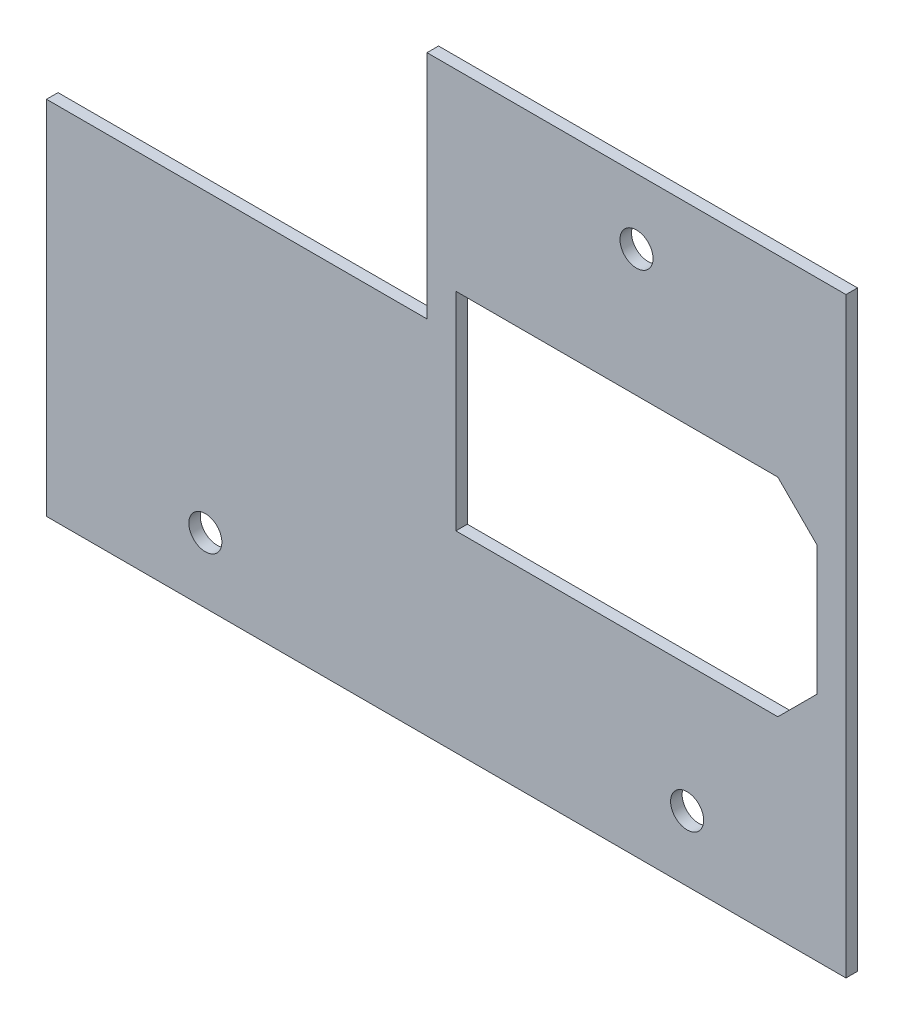
ISO-10303-21;
HEADER;
FILE_DESCRIPTION(('STEP AP214'),'2;1');
FILE_NAME('part.step','',(''),(''),'','','');
FILE_SCHEMA(('AUTOMOTIVE_DESIGN { 1 0 10303 214 1 1 1 1 }'));
ENDSEC;
DATA;
#1=APPLICATION_CONTEXT('core data for automotive mechanical design processes');
#2=APPLICATION_PROTOCOL_DEFINITION('international standard','automotive_design',2000,#1);
#3=PRODUCT_CONTEXT('',#1,'mechanical');
#4=PRODUCT('Part','Part','',(#3));
#5=PRODUCT_RELATED_PRODUCT_CATEGORY('part','',(#4));
#6=PRODUCT_DEFINITION_FORMATION('','',#4);
#7=PRODUCT_DEFINITION_CONTEXT('part definition',#1,'design');
#8=PRODUCT_DEFINITION('design','',#6,#7);
#9=PRODUCT_DEFINITION_SHAPE('','',#8);
#10=(LENGTH_UNIT() NAMED_UNIT(*) SI_UNIT(.MILLI.,.METRE.));
#11=(NAMED_UNIT(*) PLANE_ANGLE_UNIT() SI_UNIT($,.RADIAN.));
#12=(NAMED_UNIT(*) SI_UNIT($,.STERADIAN.) SOLID_ANGLE_UNIT());
#13=UNCERTAINTY_MEASURE_WITH_UNIT(LENGTH_MEASURE(1.E-05),#10,'distance_accuracy_value','');
#14=(GEOMETRIC_REPRESENTATION_CONTEXT(3) GLOBAL_UNCERTAINTY_ASSIGNED_CONTEXT((#13)) GLOBAL_UNIT_ASSIGNED_CONTEXT((#10,
#11,#12)) REPRESENTATION_CONTEXT('',''));
#15=CARTESIAN_POINT('',(0.,0.,0.));
#16=DIRECTION('',(0.,0.,1.));
#17=DIRECTION('',(1.,0.,0.));
#18=AXIS2_PLACEMENT_3D('',#15,#16,#17);
#19=CARTESIAN_POINT('',(93.499999998425,65.5289402294532,-21.5));
#20=DIRECTION('',(0.,1.,0.));
#21=DIRECTION('',(-1.,0.,0.));
#22=AXIS2_PLACEMENT_3D('',#19,#20,#21);
#23=PLANE('',#22);
#24=DIRECTION('',(-1.,0.,0.));
#25=VECTOR('',#24,1.);
#26=CARTESIAN_POINT('',(93.499999998425,65.5289402294532,-20.));
#27=LINE('',#26,#25);
#28=CARTESIAN_POINT('',(148.003126518284,65.5289402294535,-20.));
#29=VERTEX_POINT('',#28);
#30=CARTESIAN_POINT('',(93.499999998425,65.5289402294532,-20.));
#31=VERTEX_POINT('',#30);
#32=EDGE_CURVE('E243',#29,#31,#27,.T.);
#33=ORIENTED_EDGE('',*,*,#32,.F.);
#34=DIRECTION('',(0.,0.,1.));
#35=VECTOR('',#34,1.);
#36=CARTESIAN_POINT('',(148.003126518284,65.5289402294535,-21.5));
#37=LINE('',#36,#35);
#38=CARTESIAN_POINT('',(148.003126518284,65.5289402294535,-21.5));
#39=VERTEX_POINT('',#38);
#40=EDGE_CURVE('E11',#39,#29,#37,.T.);
#41=ORIENTED_EDGE('',*,*,#40,.F.);
#42=DIRECTION('',(-1.,0.,0.));
#43=VECTOR('',#42,1.);
#44=CARTESIAN_POINT('',(93.499999998425,65.5289402294532,-21.5));
#45=LINE('',#44,#43);
#46=CARTESIAN_POINT('',(93.499999998425,65.5289402294532,-21.5));
#47=VERTEX_POINT('',#46);
#48=EDGE_CURVE('E244',#39,#47,#45,.T.);
#49=ORIENTED_EDGE('',*,*,#48,.T.);
#50=DIRECTION('',(0.,0.,1.));
#51=VECTOR('',#50,1.);
#52=CARTESIAN_POINT('',(93.499999998425,65.5289402294532,-21.5));
#53=LINE('',#52,#51);
#54=EDGE_CURVE('E44',#47,#31,#53,.T.);
#55=ORIENTED_EDGE('',*,*,#54,.T.);
#56=EDGE_LOOP('',(#33,#41,#49,#55));
#57=FACE_BOUND('',#56,.T.);
#58=ADVANCED_FACE('F41',(#57),#23,.T.);
#59=CARTESIAN_POINT('',(148.003126518284,65.5289402294535,-21.5));
#60=DIRECTION('',(1.,0.,0.));
#61=DIRECTION('',(0.,1.,0.));
#62=AXIS2_PLACEMENT_3D('',#59,#60,#61);
#63=PLANE('',#62);
#64=DIRECTION('',(0.,1.,0.));
#65=VECTOR('',#64,1.);
#66=CARTESIAN_POINT('',(148.003126518284,65.5289402294535,-20.));
#67=LINE('',#66,#65);
#68=CARTESIAN_POINT('',(148.003126518284,-11.4710597708542,-20.));
#69=VERTEX_POINT('',#68);
#70=EDGE_CURVE('E249',#69,#29,#67,.T.);
#71=ORIENTED_EDGE('',*,*,#70,.F.);
#72=DIRECTION('',(0.,0.,1.));
#73=VECTOR('',#72,1.);
#74=CARTESIAN_POINT('',(148.003126518284,-11.4710597708542,-21.5));
#75=LINE('',#74,#73);
#76=CARTESIAN_POINT('',(148.003126518284,-11.4710597708542,-21.5));
#77=VERTEX_POINT('',#76);
#78=EDGE_CURVE('E50',#77,#69,#75,.T.);
#79=ORIENTED_EDGE('',*,*,#78,.F.);
#80=DIRECTION('',(0.,1.,0.));
#81=VECTOR('',#80,1.);
#82=CARTESIAN_POINT('',(148.003126518284,65.5289402294535,-21.5));
#83=LINE('',#82,#81);
#84=EDGE_CURVE('E265',#77,#39,#83,.T.);
#85=ORIENTED_EDGE('',*,*,#84,.T.);
#86=ORIENTED_EDGE('',*,*,#40,.T.);
#87=EDGE_LOOP('',(#71,#79,#85,#86));
#88=FACE_BOUND('',#87,.T.);
#89=ADVANCED_FACE('F311',(#88),#63,.T.);
#90=CARTESIAN_POINT('',(43.9999999999999,-11.4710597708542,-21.5));
#91=DIRECTION('',(0.,-1.,0.));
#92=DIRECTION('',(1.,0.,0.));
#93=AXIS2_PLACEMENT_3D('',#90,#91,#92);
#94=PLANE('',#93);
#95=DIRECTION('',(1.,0.,0.));
#96=VECTOR('',#95,1.);
#97=CARTESIAN_POINT('',(43.9999999999999,-11.4710597708542,-20.));
#98=LINE('',#97,#96);
#99=CARTESIAN_POINT('',(43.9999999999999,-11.4710597708542,-20.));
#100=VERTEX_POINT('',#99);
#101=EDGE_CURVE('E284',#100,#69,#98,.T.);
#102=ORIENTED_EDGE('',*,*,#101,.F.);
#103=DIRECTION('',(0.,0.,1.));
#104=VECTOR('',#103,1.);
#105=CARTESIAN_POINT('',(43.9999999999999,-11.4710597708542,-21.5));
#106=LINE('',#105,#104);
#107=CARTESIAN_POINT('',(43.9999999999999,-11.4710597708542,-21.5));
#108=VERTEX_POINT('',#107);
#109=EDGE_CURVE('E292',#108,#100,#106,.T.);
#110=ORIENTED_EDGE('',*,*,#109,.F.);
#111=DIRECTION('',(1.,0.,0.));
#112=VECTOR('',#111,1.);
#113=CARTESIAN_POINT('',(43.9999999999999,-11.4710597708542,-21.5));
#114=LINE('',#113,#112);
#115=EDGE_CURVE('E261',#108,#77,#114,.T.);
#116=ORIENTED_EDGE('',*,*,#115,.T.);
#117=ORIENTED_EDGE('',*,*,#78,.T.);
#118=EDGE_LOOP('',(#102,#110,#116,#117));
#119=FACE_BOUND('',#118,.T.);
#120=ADVANCED_FACE('F324',(#119),#94,.T.);
#121=CARTESIAN_POINT('',(43.9999999999999,35.5289402294536,-21.5));
#122=DIRECTION('',(-1.,0.,0.));
#123=DIRECTION('',(0.,-1.,0.));
#124=AXIS2_PLACEMENT_3D('',#121,#122,#123);
#125=PLANE('',#124);
#126=DIRECTION('',(0.,-1.,0.));
#127=VECTOR('',#126,1.);
#128=CARTESIAN_POINT('',(43.9999999999999,35.5289402294536,-20.));
#129=LINE('',#128,#127);
#130=CARTESIAN_POINT('',(43.9999999999999,35.5289402294536,-20.));
#131=VERTEX_POINT('',#130);
#132=EDGE_CURVE('E280',#131,#100,#129,.T.);
#133=ORIENTED_EDGE('',*,*,#132,.F.);
#134=DIRECTION('',(0.,0.,1.));
#135=VECTOR('',#134,1.);
#136=CARTESIAN_POINT('',(43.9999999999999,35.5289402294536,-21.5));
#137=LINE('',#136,#135);
#138=CARTESIAN_POINT('',(43.9999999999999,35.5289402294536,-21.5));
#139=VERTEX_POINT('',#138);
#140=EDGE_CURVE('E294',#139,#131,#137,.T.);
#141=ORIENTED_EDGE('',*,*,#140,.F.);
#142=DIRECTION('',(0.,-1.,0.));
#143=VECTOR('',#142,1.);
#144=CARTESIAN_POINT('',(43.9999999999999,35.5289402294536,-21.5));
#145=LINE('',#144,#143);
#146=EDGE_CURVE('E257',#139,#108,#145,.T.);
#147=ORIENTED_EDGE('',*,*,#146,.T.);
#148=ORIENTED_EDGE('',*,*,#109,.T.);
#149=EDGE_LOOP('',(#133,#141,#147,#148));
#150=FACE_BOUND('',#149,.T.);
#151=ADVANCED_FACE('F322',(#150),#125,.T.);
#152=CARTESIAN_POINT('',(93.4999999984248,35.5289402294536,-21.5));
#153=DIRECTION('',(0.,1.,0.));
#154=DIRECTION('',(-1.,0.,0.));
#155=AXIS2_PLACEMENT_3D('',#152,#153,#154);
#156=PLANE('',#155);
#157=DIRECTION('',(-1.,0.,0.));
#158=VECTOR('',#157,1.);
#159=CARTESIAN_POINT('',(93.4999999984248,35.5289402294536,-20.));
#160=LINE('',#159,#158);
#161=CARTESIAN_POINT('',(93.4999999984248,35.5289402294536,-20.));
#162=VERTEX_POINT('',#161);
#163=EDGE_CURVE('E276',#162,#131,#160,.T.);
#164=ORIENTED_EDGE('',*,*,#163,.F.);
#165=DIRECTION('',(0.,0.,1.));
#166=VECTOR('',#165,1.);
#167=CARTESIAN_POINT('',(93.4999999984248,35.5289402294536,-21.5));
#168=LINE('',#167,#166);
#169=CARTESIAN_POINT('',(93.4999999984248,35.5289402294536,-21.5));
#170=VERTEX_POINT('',#169);
#171=EDGE_CURVE('E296',#170,#162,#168,.T.);
#172=ORIENTED_EDGE('',*,*,#171,.F.);
#173=DIRECTION('',(-1.,0.,0.));
#174=VECTOR('',#173,1.);
#175=CARTESIAN_POINT('',(93.4999999984248,35.5289402294536,-21.5));
#176=LINE('',#175,#174);
#177=EDGE_CURVE('E253',#170,#139,#176,.T.);
#178=ORIENTED_EDGE('',*,*,#177,.T.);
#179=ORIENTED_EDGE('',*,*,#140,.T.);
#180=EDGE_LOOP('',(#164,#172,#178,#179));
#181=FACE_BOUND('',#180,.T.);
#182=ADVANCED_FACE('F319',(#181),#156,.T.);
#183=CARTESIAN_POINT('',(93.499999998425,65.5289402294532,-21.5));
#184=DIRECTION('',(-1.,0.,0.));
#185=DIRECTION('',(0.,-1.,0.));
#186=AXIS2_PLACEMENT_3D('',#183,#184,#185);
#187=PLANE('',#186);
#188=DIRECTION('',(0.,-1.,0.));
#189=VECTOR('',#188,1.);
#190=CARTESIAN_POINT('',(93.499999998425,65.5289402294532,-20.));
#191=LINE('',#190,#189);
#192=EDGE_CURVE('E272',#31,#162,#191,.T.);
#193=ORIENTED_EDGE('',*,*,#192,.F.);
#194=ORIENTED_EDGE('',*,*,#54,.F.);
#195=DIRECTION('',(0.,-1.,0.));
#196=VECTOR('',#195,1.);
#197=CARTESIAN_POINT('',(93.499999998425,65.5289402294532,-21.5));
#198=LINE('',#197,#196);
#199=EDGE_CURVE('E248',#47,#170,#198,.T.);
#200=ORIENTED_EDGE('',*,*,#199,.T.);
#201=ORIENTED_EDGE('',*,*,#171,.T.);
#202=EDGE_LOOP('',(#193,#194,#200,#201));
#203=FACE_BOUND('',#202,.T.);
#204=ADVANCED_FACE('F306',(#203),#187,.T.);
#205=CARTESIAN_POINT('',(0.,0.,-21.5));
#206=DIRECTION('',(0.,0.,-1.));
#207=DIRECTION('',(-1.,0.,0.));
#208=AXIS2_PLACEMENT_3D('',#205,#206,#207);
#209=PLANE('',#208);
#210=DIRECTION('',(0.,1.,0.));
#211=VECTOR('',#210,1.);
#212=CARTESIAN_POINT('',(97.2515632583544,40.5289402292996,-21.5));
#213=LINE('',#212,#211);
#214=CARTESIAN_POINT('',(97.2515632583544,13.5289402292996,-21.5));
#215=VERTEX_POINT('',#214);
#216=CARTESIAN_POINT('',(97.2515632583544,40.5289402292996,-21.5));
#217=VERTEX_POINT('',#216);
#218=EDGE_CURVE('E61',#215,#217,#213,.T.);
#219=ORIENTED_EDGE('',*,*,#218,.F.);
#220=DIRECTION('',(-1.,0.,0.));
#221=VECTOR('',#220,1.);
#222=CARTESIAN_POINT('',(97.2515632583544,13.5289402292996,-21.5));
#223=LINE('',#222,#221);
#224=CARTESIAN_POINT('',(139.139101480728,13.5289402292996,-21.5));
#225=VERTEX_POINT('',#224);
#226=EDGE_CURVE('E173',#225,#215,#223,.T.);
#227=ORIENTED_EDGE('',*,*,#226,.F.);
#228=DIRECTION('',(-0.707106781186548,-0.707106781186547,0.));
#229=VECTOR('',#228,1.);
#230=CARTESIAN_POINT('',(139.139101480728,13.5289402292996,-21.5));
#231=LINE('',#230,#229);
#232=CARTESIAN_POINT('',(144.251563258354,18.6414020069259,-21.5));
#233=VERTEX_POINT('',#232);
#234=EDGE_CURVE('E177',#233,#225,#231,.T.);
#235=ORIENTED_EDGE('',*,*,#234,.F.);
#236=DIRECTION('',(0.,-1.,0.));
#237=VECTOR('',#236,1.);
#238=CARTESIAN_POINT('',(144.251563258354,35.4164784516734,-21.5));
#239=LINE('',#238,#237);
#240=CARTESIAN_POINT('',(144.251563258354,35.4164784516734,-21.5));
#241=VERTEX_POINT('',#240);
#242=EDGE_CURVE('E200',#241,#233,#239,.T.);
#243=ORIENTED_EDGE('',*,*,#242,.F.);
#244=DIRECTION('',(0.707106781186548,-0.707106781186547,0.));
#245=VECTOR('',#244,1.);
#246=CARTESIAN_POINT('',(139.139101480728,40.5289402292996,-21.5));
#247=LINE('',#246,#245);
#248=CARTESIAN_POINT('',(139.139101480728,40.5289402292996,-21.5));
#249=VERTEX_POINT('',#248);
#250=EDGE_CURVE('E196',#249,#241,#247,.T.);
#251=ORIENTED_EDGE('',*,*,#250,.F.);
#252=DIRECTION('',(1.,0.,0.));
#253=VECTOR('',#252,1.);
#254=CARTESIAN_POINT('',(97.2515632583544,40.5289402292996,-21.5));
#255=LINE('',#254,#253);
#256=EDGE_CURVE('E193',#217,#249,#255,.T.);
#257=ORIENTED_EDGE('',*,*,#256,.F.);
#258=EDGE_LOOP('',(#219,#227,#235,#243,#251,#257));
#259=FACE_BOUND('',#258,.T.);
#260=CARTESIAN_POINT('',(120.751563258354,57.0289402294535,-21.5));
#261=DIRECTION('',(0.,0.,-1.));
#262=DIRECTION('',(-1.,0.,0.));
#263=AXIS2_PLACEMENT_3D('',#260,#261,#262);
#264=CIRCLE('',#263,2.15);
#265=CARTESIAN_POINT('',(118.601563258354,57.0289402294535,-21.5));
#266=VERTEX_POINT('',#265);
#267=EDGE_CURVE('E210',#266,#266,#264,.T.);
#268=ORIENTED_EDGE('',*,*,#267,.F.);
#269=EDGE_LOOP('',(#268));
#270=FACE_BOUND('',#269,.T.);
#271=CARTESIAN_POINT('',(127.339384783388,-2.97105977085422,-21.5));
#272=DIRECTION('',(0.,0.,-1.));
#273=DIRECTION('',(-1.,0.,0.));
#274=AXIS2_PLACEMENT_3D('',#271,#272,#273);
#275=CIRCLE('',#274,2.14999999999999);
#276=CARTESIAN_POINT('',(125.189384783388,-2.97105977085422,-21.5));
#277=VERTEX_POINT('',#276);
#278=EDGE_CURVE('E229',#277,#277,#275,.T.);
#279=ORIENTED_EDGE('',*,*,#278,.F.);
#280=EDGE_LOOP('',(#279));
#281=FACE_BOUND('',#280,.T.);
#282=CARTESIAN_POINT('',(64.6637417348955,-2.97105977085421,-21.5));
#283=DIRECTION('',(0.,0.,-1.));
#284=DIRECTION('',(-1.,0.,0.));
#285=AXIS2_PLACEMENT_3D('',#282,#283,#284);
#286=CIRCLE('',#285,2.15);
#287=CARTESIAN_POINT('',(62.5137417348955,-2.97105977085421,-21.5));
#288=VERTEX_POINT('',#287);
#289=EDGE_CURVE('E235',#288,#288,#286,.T.);
#290=ORIENTED_EDGE('',*,*,#289,.F.);
#291=EDGE_LOOP('',(#290));
#292=FACE_BOUND('',#291,.T.);
#293=ORIENTED_EDGE('',*,*,#48,.F.);
#294=ORIENTED_EDGE('',*,*,#84,.F.);
#295=ORIENTED_EDGE('',*,*,#115,.F.);
#296=ORIENTED_EDGE('',*,*,#146,.F.);
#297=ORIENTED_EDGE('',*,*,#177,.F.);
#298=ORIENTED_EDGE('',*,*,#199,.F.);
#299=EDGE_LOOP('',(#293,#294,#295,#296,#297,#298));
#300=FACE_BOUND('',#299,.T.);
#301=ADVANCED_FACE('F314',(#259,#270,#281,#292,#300),#209,.T.);
#302=CARTESIAN_POINT('',(0.,0.,-20.));
#303=DIRECTION('',(0.,0.,-1.));
#304=DIRECTION('',(-1.,0.,0.));
#305=AXIS2_PLACEMENT_3D('',#302,#303,#304);
#306=PLANE('',#305);
#307=DIRECTION('',(-1.,0.,0.));
#308=VECTOR('',#307,1.);
#309=CARTESIAN_POINT('',(97.2515632583544,13.5289402292996,-20.));
#310=LINE('',#309,#308);
#311=CARTESIAN_POINT('',(139.139101480728,13.5289402292996,-20.));
#312=VERTEX_POINT('',#311);
#313=CARTESIAN_POINT('',(97.2515632583544,13.5289402292996,-20.));
#314=VERTEX_POINT('',#313);
#315=EDGE_CURVE('E160',#312,#314,#310,.T.);
#316=ORIENTED_EDGE('',*,*,#315,.T.);
#317=DIRECTION('',(0.,1.,0.));
#318=VECTOR('',#317,1.);
#319=CARTESIAN_POINT('',(97.2515632583544,40.5289402292996,-20.));
#320=LINE('',#319,#318);
#321=CARTESIAN_POINT('',(97.2515632583544,40.5289402292996,-20.));
#322=VERTEX_POINT('',#321);
#323=EDGE_CURVE('E153',#314,#322,#320,.T.);
#324=ORIENTED_EDGE('',*,*,#323,.T.);
#325=DIRECTION('',(1.,0.,0.));
#326=VECTOR('',#325,1.);
#327=CARTESIAN_POINT('',(97.2515632583544,40.5289402292996,-20.));
#328=LINE('',#327,#326);
#329=CARTESIAN_POINT('',(139.139101480728,40.5289402292996,-20.));
#330=VERTEX_POINT('',#329);
#331=EDGE_CURVE('E163',#322,#330,#328,.T.);
#332=ORIENTED_EDGE('',*,*,#331,.T.);
#333=DIRECTION('',(0.707106781186548,-0.707106781186547,0.));
#334=VECTOR('',#333,1.);
#335=CARTESIAN_POINT('',(139.139101480728,40.5289402292996,-20.));
#336=LINE('',#335,#334);
#337=CARTESIAN_POINT('',(144.251563258354,35.4164784516734,-20.));
#338=VERTEX_POINT('',#337);
#339=EDGE_CURVE('E72',#330,#338,#336,.T.);
#340=ORIENTED_EDGE('',*,*,#339,.T.);
#341=DIRECTION('',(0.,-1.,0.));
#342=VECTOR('',#341,1.);
#343=CARTESIAN_POINT('',(144.251563258354,35.4164784516734,-20.));
#344=LINE('',#343,#342);
#345=CARTESIAN_POINT('',(144.251563258354,18.6414020069259,-20.));
#346=VERTEX_POINT('',#345);
#347=EDGE_CURVE('E182',#338,#346,#344,.T.);
#348=ORIENTED_EDGE('',*,*,#347,.T.);
#349=DIRECTION('',(-0.707106781186548,-0.707106781186547,0.));
#350=VECTOR('',#349,1.);
#351=CARTESIAN_POINT('',(139.139101480728,13.5289402292996,-20.));
#352=LINE('',#351,#350);
#353=EDGE_CURVE('E186',#346,#312,#352,.T.);
#354=ORIENTED_EDGE('',*,*,#353,.T.);
#355=EDGE_LOOP('',(#316,#324,#332,#340,#348,#354));
#356=FACE_BOUND('',#355,.T.);
#357=CARTESIAN_POINT('',(120.751563258354,57.0289402294535,-20.));
#358=DIRECTION('',(0.,0.,-1.));
#359=DIRECTION('',(-1.,0.,0.));
#360=AXIS2_PLACEMENT_3D('',#357,#358,#359);
#361=CIRCLE('',#360,2.15);
#362=CARTESIAN_POINT('',(118.601563258354,57.0289402294535,-20.));
#363=VERTEX_POINT('',#362);
#364=EDGE_CURVE('E225',#363,#363,#361,.T.);
#365=ORIENTED_EDGE('',*,*,#364,.T.);
#366=EDGE_LOOP('',(#365));
#367=FACE_BOUND('',#366,.T.);
#368=CARTESIAN_POINT('',(127.339384783388,-2.97105977085422,-20.));
#369=DIRECTION('',(0.,0.,-1.));
#370=DIRECTION('',(-1.,0.,0.));
#371=AXIS2_PLACEMENT_3D('',#368,#369,#370);
#372=CIRCLE('',#371,2.14999999999999);
#373=CARTESIAN_POINT('',(125.189384783388,-2.97105977085422,-20.));
#374=VERTEX_POINT('',#373);
#375=EDGE_CURVE('E232',#374,#374,#372,.T.);
#376=ORIENTED_EDGE('',*,*,#375,.T.);
#377=EDGE_LOOP('',(#376));
#378=FACE_BOUND('',#377,.T.);
#379=CARTESIAN_POINT('',(64.6637417348955,-2.97105977085421,-20.));
#380=DIRECTION('',(0.,0.,-1.));
#381=DIRECTION('',(-1.,0.,0.));
#382=AXIS2_PLACEMENT_3D('',#379,#380,#381);
#383=CIRCLE('',#382,2.15);
#384=CARTESIAN_POINT('',(62.5137417348955,-2.97105977085421,-20.));
#385=VERTEX_POINT('',#384);
#386=EDGE_CURVE('E239',#385,#385,#383,.T.);
#387=ORIENTED_EDGE('',*,*,#386,.T.);
#388=EDGE_LOOP('',(#387));
#389=FACE_BOUND('',#388,.T.);
#390=ORIENTED_EDGE('',*,*,#32,.T.);
#391=ORIENTED_EDGE('',*,*,#192,.T.);
#392=ORIENTED_EDGE('',*,*,#163,.T.);
#393=ORIENTED_EDGE('',*,*,#132,.T.);
#394=ORIENTED_EDGE('',*,*,#101,.T.);
#395=ORIENTED_EDGE('',*,*,#70,.T.);
#396=EDGE_LOOP('',(#390,#391,#392,#393,#394,#395));
#397=FACE_BOUND('',#396,.T.);
#398=ADVANCED_FACE('F168',(#356,#367,#378,#389,#397),#306,.F.);
#399=CARTESIAN_POINT('',(64.6637417348955,-2.97105977085421,-21.5));
#400=DIRECTION('',(0.,0.,-1.));
#401=DIRECTION('',(-1.,0.,0.));
#402=AXIS2_PLACEMENT_3D('',#399,#400,#401);
#403=CYLINDRICAL_SURFACE('',#402,2.15);
#404=ORIENTED_EDGE('',*,*,#289,.T.);
#405=EDGE_LOOP('',(#404));
#406=FACE_BOUND('',#405,.T.);
#407=ORIENTED_EDGE('',*,*,#386,.F.);
#408=EDGE_LOOP('',(#407));
#409=FACE_BOUND('',#408,.T.);
#410=ADVANCED_FACE('F372',(#406,#409),#403,.F.);
#411=CARTESIAN_POINT('',(127.339384783388,-2.97105977085422,-21.5));
#412=DIRECTION('',(0.,0.,-1.));
#413=DIRECTION('',(-1.,0.,0.));
#414=AXIS2_PLACEMENT_3D('',#411,#412,#413);
#415=CYLINDRICAL_SURFACE('',#414,2.14999999999999);
#416=ORIENTED_EDGE('',*,*,#278,.T.);
#417=EDGE_LOOP('',(#416));
#418=FACE_BOUND('',#417,.T.);
#419=ORIENTED_EDGE('',*,*,#375,.F.);
#420=EDGE_LOOP('',(#419));
#421=FACE_BOUND('',#420,.T.);
#422=ADVANCED_FACE('F377',(#418,#421),#415,.F.);
#423=CARTESIAN_POINT('',(120.751563258354,57.0289402294535,-21.5));
#424=DIRECTION('',(0.,0.,-1.));
#425=DIRECTION('',(-1.,0.,0.));
#426=AXIS2_PLACEMENT_3D('',#423,#424,#425);
#427=CYLINDRICAL_SURFACE('',#426,2.15);
#428=ORIENTED_EDGE('',*,*,#267,.T.);
#429=EDGE_LOOP('',(#428));
#430=FACE_BOUND('',#429,.T.);
#431=ORIENTED_EDGE('',*,*,#364,.F.);
#432=EDGE_LOOP('',(#431));
#433=FACE_BOUND('',#432,.T.);
#434=ADVANCED_FACE('F389',(#430,#433),#427,.F.);
#435=CARTESIAN_POINT('',(97.2515632583544,40.5289402292996,-20.));
#436=DIRECTION('',(-1.,0.,0.));
#437=DIRECTION('',(0.,-1.,0.));
#438=AXIS2_PLACEMENT_3D('',#435,#436,#437);
#439=PLANE('',#438);
#440=ORIENTED_EDGE('',*,*,#218,.T.);
#441=DIRECTION('',(0.,0.,-1.));
#442=VECTOR('',#441,1.);
#443=CARTESIAN_POINT('',(97.2515632583544,40.5289402292996,-20.));
#444=LINE('',#443,#442);
#445=EDGE_CURVE('E149',#322,#217,#444,.T.);
#446=ORIENTED_EDGE('',*,*,#445,.F.);
#447=ORIENTED_EDGE('',*,*,#323,.F.);
#448=DIRECTION('',(0.,0.,-1.));
#449=VECTOR('',#448,1.);
#450=CARTESIAN_POINT('',(97.2515632583544,13.5289402292996,-20.));
#451=LINE('',#450,#449);
#452=EDGE_CURVE('E207',#314,#215,#451,.T.);
#453=ORIENTED_EDGE('',*,*,#452,.T.);
#454=EDGE_LOOP('',(#440,#446,#447,#453));
#455=FACE_BOUND('',#454,.T.);
#456=ADVANCED_FACE('F151',(#455),#439,.F.);
#457=CARTESIAN_POINT('',(97.2515632583544,13.5289402292996,-20.));
#458=DIRECTION('',(0.,-1.,0.));
#459=DIRECTION('',(1.,0.,0.));
#460=AXIS2_PLACEMENT_3D('',#457,#458,#459);
#461=PLANE('',#460);
#462=ORIENTED_EDGE('',*,*,#226,.T.);
#463=ORIENTED_EDGE('',*,*,#452,.F.);
#464=ORIENTED_EDGE('',*,*,#315,.F.);
#465=DIRECTION('',(0.,0.,-1.));
#466=VECTOR('',#465,1.);
#467=CARTESIAN_POINT('',(139.139101480728,13.5289402292996,-20.));
#468=LINE('',#467,#466);
#469=EDGE_CURVE('E211',#312,#225,#468,.T.);
#470=ORIENTED_EDGE('',*,*,#469,.T.);
#471=EDGE_LOOP('',(#462,#463,#464,#470));
#472=FACE_BOUND('',#471,.T.);
#473=ADVANCED_FACE('F421',(#472),#461,.F.);
#474=CARTESIAN_POINT('',(139.139101480728,13.5289402292996,-20.));
#475=DIRECTION('',(0.707106781186547,-0.707106781186548,0.));
#476=DIRECTION('',(0.707106781186548,0.707106781186547,0.));
#477=AXIS2_PLACEMENT_3D('',#474,#475,#476);
#478=PLANE('',#477);
#479=ORIENTED_EDGE('',*,*,#234,.T.);
#480=ORIENTED_EDGE('',*,*,#469,.F.);
#481=ORIENTED_EDGE('',*,*,#353,.F.);
#482=DIRECTION('',(0.,0.,-1.));
#483=VECTOR('',#482,1.);
#484=CARTESIAN_POINT('',(144.251563258354,18.6414020069259,-20.));
#485=LINE('',#484,#483);
#486=EDGE_CURVE('E214',#346,#233,#485,.T.);
#487=ORIENTED_EDGE('',*,*,#486,.T.);
#488=EDGE_LOOP('',(#479,#480,#481,#487));
#489=FACE_BOUND('',#488,.T.);
#490=ADVANCED_FACE('F430',(#489),#478,.F.);
#491=CARTESIAN_POINT('',(144.251563258354,35.4164784516734,-20.));
#492=DIRECTION('',(1.,0.,0.));
#493=DIRECTION('',(0.,0.,-1.));
#494=AXIS2_PLACEMENT_3D('',#491,#492,#493);
#495=PLANE('',#494);
#496=ORIENTED_EDGE('',*,*,#242,.T.);
#497=ORIENTED_EDGE('',*,*,#486,.F.);
#498=ORIENTED_EDGE('',*,*,#347,.F.);
#499=DIRECTION('',(0.,0.,-1.));
#500=VECTOR('',#499,1.);
#501=CARTESIAN_POINT('',(144.251563258354,35.4164784516734,-20.));
#502=LINE('',#501,#500);
#503=EDGE_CURVE('E217',#338,#241,#502,.T.);
#504=ORIENTED_EDGE('',*,*,#503,.T.);
#505=EDGE_LOOP('',(#496,#497,#498,#504));
#506=FACE_BOUND('',#505,.T.);
#507=ADVANCED_FACE('F440',(#506),#495,.F.);
#508=CARTESIAN_POINT('',(139.139101480728,40.5289402292996,-20.));
#509=DIRECTION('',(0.707106781186547,0.707106781186548,0.));
#510=DIRECTION('',(-0.707106781186548,0.707106781186547,0.));
#511=AXIS2_PLACEMENT_3D('',#508,#509,#510);
#512=PLANE('',#511);
#513=ORIENTED_EDGE('',*,*,#250,.T.);
#514=ORIENTED_EDGE('',*,*,#503,.F.);
#515=ORIENTED_EDGE('',*,*,#339,.F.);
#516=DIRECTION('',(0.,0.,-1.));
#517=VECTOR('',#516,1.);
#518=CARTESIAN_POINT('',(139.139101480728,40.5289402292996,-20.));
#519=LINE('',#518,#517);
#520=EDGE_CURVE('E159',#330,#249,#519,.T.);
#521=ORIENTED_EDGE('',*,*,#520,.T.);
#522=EDGE_LOOP('',(#513,#514,#515,#521));
#523=FACE_BOUND('',#522,.T.);
#524=ADVANCED_FACE('F450',(#523),#512,.F.);
#525=CARTESIAN_POINT('',(97.2515632583544,40.5289402292996,-20.));
#526=DIRECTION('',(0.,1.,0.));
#527=DIRECTION('',(-1.,0.,0.));
#528=AXIS2_PLACEMENT_3D('',#525,#526,#527);
#529=PLANE('',#528);
#530=ORIENTED_EDGE('',*,*,#256,.T.);
#531=ORIENTED_EDGE('',*,*,#520,.F.);
#532=ORIENTED_EDGE('',*,*,#331,.F.);
#533=ORIENTED_EDGE('',*,*,#445,.T.);
#534=EDGE_LOOP('',(#530,#531,#532,#533));
#535=FACE_BOUND('',#534,.T.);
#536=ADVANCED_FACE('F164',(#535),#529,.F.);
#537=CLOSED_SHELL('',(#58,#89,#120,#151,#182,#204,#301,#398,#410,#422,#434,#456,#473,#490,#507,
#524,#536));
#538=MANIFOLD_SOLID_BREP('B2',#537);
#539=ADVANCED_BREP_SHAPE_REPRESENTATION('',(#18,#538),#14);
#540=SHAPE_DEFINITION_REPRESENTATION(#9,#539);
ENDSEC;
END-ISO-10303-21;
